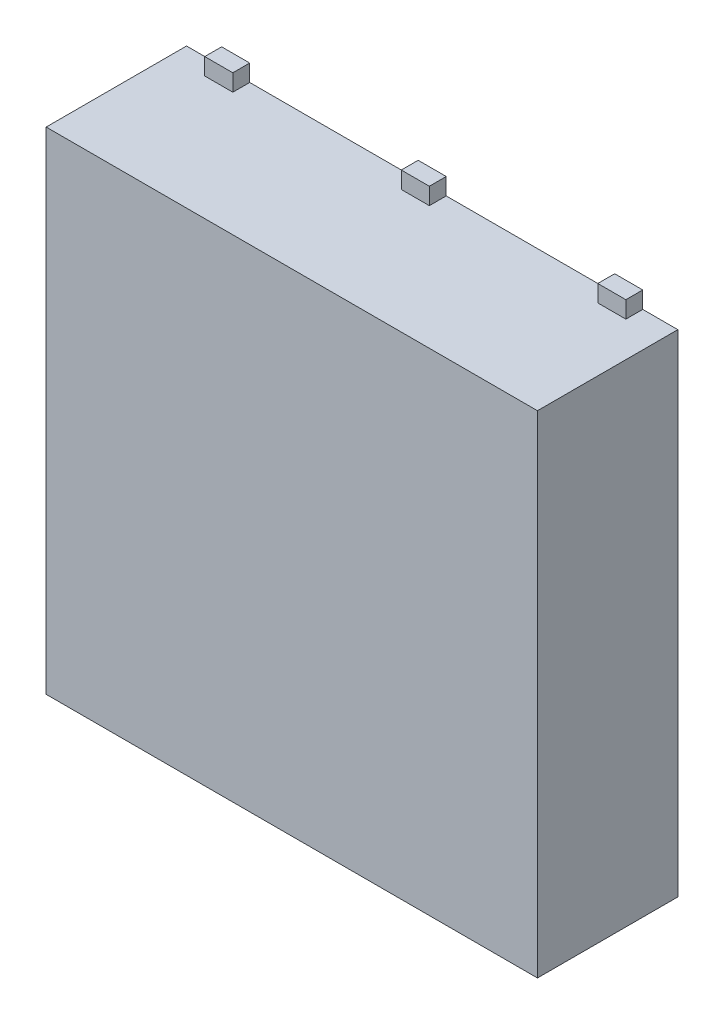
ISO-10303-21;
HEADER;
FILE_DESCRIPTION(('STEP AP214'),'2;1');
FILE_NAME('part.step','',(''),(''),'','','');
FILE_SCHEMA(('AUTOMOTIVE_DESIGN { 1 0 10303 214 1 1 1 1 }'));
ENDSEC;
DATA;
#1=APPLICATION_CONTEXT('core data for automotive mechanical design processes');
#2=APPLICATION_PROTOCOL_DEFINITION('international standard','automotive_design',2000,#1);
#3=PRODUCT_CONTEXT('',#1,'mechanical');
#4=PRODUCT('Part','Part','',(#3));
#5=PRODUCT_RELATED_PRODUCT_CATEGORY('part','',(#4));
#6=PRODUCT_DEFINITION_FORMATION('','',#4);
#7=PRODUCT_DEFINITION_CONTEXT('part definition',#1,'design');
#8=PRODUCT_DEFINITION('design','',#6,#7);
#9=PRODUCT_DEFINITION_SHAPE('','',#8);
#10=(LENGTH_UNIT() NAMED_UNIT(*) SI_UNIT(.MILLI.,.METRE.));
#11=(NAMED_UNIT(*) PLANE_ANGLE_UNIT() SI_UNIT($,.RADIAN.));
#12=(NAMED_UNIT(*) SI_UNIT($,.STERADIAN.) SOLID_ANGLE_UNIT());
#13=UNCERTAINTY_MEASURE_WITH_UNIT(LENGTH_MEASURE(1.E-05),#10,'distance_accuracy_value','');
#14=(GEOMETRIC_REPRESENTATION_CONTEXT(3) GLOBAL_UNCERTAINTY_ASSIGNED_CONTEXT((#13)) GLOBAL_UNIT_ASSIGNED_CONTEXT((#10,
#11,#12)) REPRESENTATION_CONTEXT('',''));
#15=CARTESIAN_POINT('',(0.,0.,0.));
#16=DIRECTION('',(0.,0.,1.));
#17=DIRECTION('',(1.,0.,0.));
#18=AXIS2_PLACEMENT_3D('',#15,#16,#17);
#19=CARTESIAN_POINT('',(-1.75,1.75,1.));
#20=DIRECTION('',(0.,-1.,0.));
#21=DIRECTION('',(1.,0.,0.));
#22=AXIS2_PLACEMENT_3D('',#19,#20,#21);
#23=PLANE('',#22);
#24=DIRECTION('',(0.,0.,1.));
#25=VECTOR('',#24,1.);
#26=CARTESIAN_POINT('',(1.3,1.75,0.));
#27=LINE('',#26,#25);
#28=CARTESIAN_POINT('',(1.3,1.75,0.));
#29=VERTEX_POINT('',#28);
#30=CARTESIAN_POINT('',(1.3,1.75,0.120247062166505));
#31=VERTEX_POINT('',#30);
#32=EDGE_CURVE('E316',#29,#31,#27,.T.);
#33=ORIENTED_EDGE('',*,*,#32,.F.);
#34=DIRECTION('',(-1.,0.,0.));
#35=VECTOR('',#34,1.);
#36=CARTESIAN_POINT('',(-1.75,1.75,0.));
#37=LINE('',#36,#35);
#38=CARTESIAN_POINT('',(0.0999999999999998,1.75,0.));
#39=VERTEX_POINT('',#38);
#40=EDGE_CURVE('E429',#29,#39,#37,.T.);
#41=ORIENTED_EDGE('',*,*,#40,.T.);
#42=DIRECTION('',(0.,0.,-1.));
#43=VECTOR('',#42,1.);
#44=CARTESIAN_POINT('',(0.0999999999999997,1.75,0.));
#45=LINE('',#44,#43);
#46=CARTESIAN_POINT('',(0.0999999999999999,1.75,0.120247062166505));
#47=VERTEX_POINT('',#46);
#48=EDGE_CURVE('E381',#47,#39,#45,.T.);
#49=ORIENTED_EDGE('',*,*,#48,.F.);
#50=DIRECTION('',(1.,0.,0.));
#51=VECTOR('',#50,1.);
#52=CARTESIAN_POINT('',(-0.1,1.75,0.120247062166505));
#53=LINE('',#52,#51);
#54=CARTESIAN_POINT('',(-0.1,1.75,0.120247062166505));
#55=VERTEX_POINT('',#54);
#56=EDGE_CURVE('E390',#55,#47,#53,.T.);
#57=ORIENTED_EDGE('',*,*,#56,.F.);
#58=DIRECTION('',(0.,0.,1.));
#59=VECTOR('',#58,1.);
#60=CARTESIAN_POINT('',(-0.1,1.75,0.));
#61=LINE('',#60,#59);
#62=CARTESIAN_POINT('',(-0.1,1.75,0.));
#63=VERTEX_POINT('',#62);
#64=EDGE_CURVE('E376',#63,#55,#61,.T.);
#65=ORIENTED_EDGE('',*,*,#64,.F.);
#66=CARTESIAN_POINT('',(-1.3,1.75,0.));
#67=VERTEX_POINT('',#66);
#68=EDGE_CURVE('E430',#63,#67,#37,.T.);
#69=ORIENTED_EDGE('',*,*,#68,.T.);
#70=DIRECTION('',(0.,0.,-1.));
#71=VECTOR('',#70,1.);
#72=CARTESIAN_POINT('',(-1.3,1.75,0.));
#73=LINE('',#72,#71);
#74=CARTESIAN_POINT('',(-1.3,1.75,0.120247062166505));
#75=VERTEX_POINT('',#74);
#76=EDGE_CURVE('E351',#75,#67,#73,.T.);
#77=ORIENTED_EDGE('',*,*,#76,.F.);
#78=DIRECTION('',(1.,0.,0.));
#79=VECTOR('',#78,1.);
#80=CARTESIAN_POINT('',(-1.5,1.75,0.120247062166505));
#81=LINE('',#80,#79);
#82=CARTESIAN_POINT('',(-1.5,1.75,0.120247062166505));
#83=VERTEX_POINT('',#82);
#84=EDGE_CURVE('E360',#83,#75,#81,.T.);
#85=ORIENTED_EDGE('',*,*,#84,.F.);
#86=DIRECTION('',(0.,0.,1.));
#87=VECTOR('',#86,1.);
#88=CARTESIAN_POINT('',(-1.5,1.75,0.));
#89=LINE('',#88,#87);
#90=CARTESIAN_POINT('',(-1.5,1.75,0.));
#91=VERTEX_POINT('',#90);
#92=EDGE_CURVE('E346',#91,#83,#89,.T.);
#93=ORIENTED_EDGE('',*,*,#92,.F.);
#94=CARTESIAN_POINT('',(-1.75,1.75,0.));
#95=VERTEX_POINT('',#94);
#96=EDGE_CURVE('E427',#91,#95,#37,.T.);
#97=ORIENTED_EDGE('',*,*,#96,.T.);
#98=DIRECTION('',(0.,0.,-1.));
#99=VECTOR('',#98,1.);
#100=CARTESIAN_POINT('',(-1.75,1.75,1.));
#101=LINE('',#100,#99);
#102=CARTESIAN_POINT('',(-1.75,1.75,1.));
#103=VERTEX_POINT('',#102);
#104=EDGE_CURVE('E417',#103,#95,#101,.T.);
#105=ORIENTED_EDGE('',*,*,#104,.F.);
#106=DIRECTION('',(-1.,0.,0.));
#107=VECTOR('',#106,1.);
#108=CARTESIAN_POINT('',(-1.75,1.75,1.));
#109=LINE('',#108,#107);
#110=CARTESIAN_POINT('',(1.75,1.75,1.));
#111=VERTEX_POINT('',#110);
#112=EDGE_CURVE('E415',#111,#103,#109,.T.);
#113=ORIENTED_EDGE('',*,*,#112,.F.);
#114=DIRECTION('',(0.,0.,-1.));
#115=VECTOR('',#114,1.);
#116=CARTESIAN_POINT('',(1.75,1.75,1.));
#117=LINE('',#116,#115);
#118=CARTESIAN_POINT('',(1.75,1.75,0.));
#119=VERTEX_POINT('',#118);
#120=EDGE_CURVE('E433',#111,#119,#117,.T.);
#121=ORIENTED_EDGE('',*,*,#120,.T.);
#122=CARTESIAN_POINT('',(1.5,1.75,0.));
#123=VERTEX_POINT('',#122);
#124=EDGE_CURVE('E411',#119,#123,#37,.T.);
#125=ORIENTED_EDGE('',*,*,#124,.T.);
#126=DIRECTION('',(0.,0.,-1.));
#127=VECTOR('',#126,1.);
#128=CARTESIAN_POINT('',(1.5,1.75,0.));
#129=LINE('',#128,#127);
#130=CARTESIAN_POINT('',(1.5,1.75,0.120247062166505));
#131=VERTEX_POINT('',#130);
#132=EDGE_CURVE('E321',#131,#123,#129,.T.);
#133=ORIENTED_EDGE('',*,*,#132,.F.);
#134=DIRECTION('',(1.,0.,0.));
#135=VECTOR('',#134,1.);
#136=CARTESIAN_POINT('',(1.3,1.75,0.120247062166505));
#137=LINE('',#136,#135);
#138=EDGE_CURVE('E330',#31,#131,#137,.T.);
#139=ORIENTED_EDGE('',*,*,#138,.F.);
#140=EDGE_LOOP('',(#33,#41,#49,#57,#65,#69,#77,#85,#93,#97,#105,#113,#121,#125,#133,#139));
#141=FACE_BOUND('',#140,.T.);
#142=ADVANCED_FACE('F34',(#141),#23,.F.);
#143=CARTESIAN_POINT('',(-1.75,1.75,1.));
#144=DIRECTION('',(1.,0.,0.));
#145=DIRECTION('',(0.,0.,-1.));
#146=AXIS2_PLACEMENT_3D('',#143,#144,#145);
#147=PLANE('',#146);
#148=DIRECTION('',(0.,-1.,0.));
#149=VECTOR('',#148,1.);
#150=CARTESIAN_POINT('',(-1.75,1.75,0.));
#151=LINE('',#150,#149);
#152=CARTESIAN_POINT('',(-1.75,-1.75,0.));
#153=VERTEX_POINT('',#152);
#154=EDGE_CURVE('E406',#95,#153,#151,.T.);
#155=ORIENTED_EDGE('',*,*,#154,.T.);
#156=DIRECTION('',(0.,0.,-1.));
#157=VECTOR('',#156,1.);
#158=CARTESIAN_POINT('',(-1.75,-1.75,1.));
#159=LINE('',#158,#157);
#160=CARTESIAN_POINT('',(-1.75,-1.75,1.));
#161=VERTEX_POINT('',#160);
#162=EDGE_CURVE('E11',#161,#153,#159,.T.);
#163=ORIENTED_EDGE('',*,*,#162,.F.);
#164=DIRECTION('',(0.,-1.,0.));
#165=VECTOR('',#164,1.);
#166=CARTESIAN_POINT('',(-1.75,1.75,1.));
#167=LINE('',#166,#165);
#168=EDGE_CURVE('E407',#103,#161,#167,.T.);
#169=ORIENTED_EDGE('',*,*,#168,.F.);
#170=ORIENTED_EDGE('',*,*,#104,.T.);
#171=EDGE_LOOP('',(#155,#163,#169,#170));
#172=FACE_BOUND('',#171,.T.);
#173=ADVANCED_FACE('F36',(#172),#147,.F.);
#174=CARTESIAN_POINT('',(-1.75,-1.75,1.));
#175=DIRECTION('',(0.,1.,0.));
#176=DIRECTION('',(-1.,0.,0.));
#177=AXIS2_PLACEMENT_3D('',#174,#175,#176);
#178=PLANE('',#177);
#179=DIRECTION('',(1.,0.,0.));
#180=VECTOR('',#179,1.);
#181=CARTESIAN_POINT('',(-1.75,-1.75,0.));
#182=LINE('',#181,#180);
#183=CARTESIAN_POINT('',(0.0999999999999998,-1.75,0.));
#184=VERTEX_POINT('',#183);
#185=CARTESIAN_POINT('',(1.3,-1.75,0.));
#186=VERTEX_POINT('',#185);
#187=EDGE_CURVE('E425',#184,#186,#182,.T.);
#188=ORIENTED_EDGE('',*,*,#187,.T.);
#189=DIRECTION('',(0.,0.,1.));
#190=VECTOR('',#189,1.);
#191=CARTESIAN_POINT('',(1.3,-1.75,0.));
#192=LINE('',#191,#190);
#193=CARTESIAN_POINT('',(1.3,-1.75,0.120247062166505));
#194=VERTEX_POINT('',#193);
#195=EDGE_CURVE('E54',#186,#194,#192,.T.);
#196=ORIENTED_EDGE('',*,*,#195,.T.);
#197=DIRECTION('',(1.,0.,0.));
#198=VECTOR('',#197,1.);
#199=CARTESIAN_POINT('',(1.3,-1.75,0.120247062166505));
#200=LINE('',#199,#198);
#201=CARTESIAN_POINT('',(1.5,-1.75,0.120247062166505));
#202=VERTEX_POINT('',#201);
#203=EDGE_CURVE('E49',#194,#202,#200,.T.);
#204=ORIENTED_EDGE('',*,*,#203,.T.);
#205=DIRECTION('',(0.,0.,-1.));
#206=VECTOR('',#205,1.);
#207=CARTESIAN_POINT('',(1.5,-1.75,0.));
#208=LINE('',#207,#206);
#209=CARTESIAN_POINT('',(1.5,-1.75,0.));
#210=VERTEX_POINT('',#209);
#211=EDGE_CURVE('E249',#202,#210,#208,.T.);
#212=ORIENTED_EDGE('',*,*,#211,.T.);
#213=CARTESIAN_POINT('',(1.75,-1.75,0.));
#214=VERTEX_POINT('',#213);
#215=EDGE_CURVE('E420',#210,#214,#182,.T.);
#216=ORIENTED_EDGE('',*,*,#215,.T.);
#217=DIRECTION('',(0.,0.,-1.));
#218=VECTOR('',#217,1.);
#219=CARTESIAN_POINT('',(1.75,-1.75,1.));
#220=LINE('',#219,#218);
#221=CARTESIAN_POINT('',(1.75,-1.75,1.));
#222=VERTEX_POINT('',#221);
#223=EDGE_CURVE('E42',#222,#214,#220,.T.);
#224=ORIENTED_EDGE('',*,*,#223,.F.);
#225=DIRECTION('',(1.,0.,0.));
#226=VECTOR('',#225,1.);
#227=CARTESIAN_POINT('',(-1.75,-1.75,1.));
#228=LINE('',#227,#226);
#229=EDGE_CURVE('E410',#161,#222,#228,.T.);
#230=ORIENTED_EDGE('',*,*,#229,.F.);
#231=ORIENTED_EDGE('',*,*,#162,.T.);
#232=CARTESIAN_POINT('',(-1.5,-1.75,0.));
#233=VERTEX_POINT('',#232);
#234=EDGE_CURVE('E421',#153,#233,#182,.T.);
#235=ORIENTED_EDGE('',*,*,#234,.T.);
#236=DIRECTION('',(0.,0.,1.));
#237=VECTOR('',#236,1.);
#238=CARTESIAN_POINT('',(-1.5,-1.75,0.));
#239=LINE('',#238,#237);
#240=CARTESIAN_POINT('',(-1.5,-1.75,0.120247062166505));
#241=VERTEX_POINT('',#240);
#242=EDGE_CURVE('E227',#233,#241,#239,.T.);
#243=ORIENTED_EDGE('',*,*,#242,.T.);
#244=DIRECTION('',(1.,0.,0.));
#245=VECTOR('',#244,1.);
#246=CARTESIAN_POINT('',(-1.5,-1.75,0.120247062166505));
#247=LINE('',#246,#245);
#248=CARTESIAN_POINT('',(-1.3,-1.75,0.120247062166505));
#249=VERTEX_POINT('',#248);
#250=EDGE_CURVE('E260',#241,#249,#247,.T.);
#251=ORIENTED_EDGE('',*,*,#250,.T.);
#252=DIRECTION('',(0.,0.,-1.));
#253=VECTOR('',#252,1.);
#254=CARTESIAN_POINT('',(-1.3,-1.75,0.));
#255=LINE('',#254,#253);
#256=CARTESIAN_POINT('',(-1.3,-1.75,0.));
#257=VERTEX_POINT('',#256);
#258=EDGE_CURVE('E271',#249,#257,#255,.T.);
#259=ORIENTED_EDGE('',*,*,#258,.T.);
#260=CARTESIAN_POINT('',(-0.1,-1.75,0.));
#261=VERTEX_POINT('',#260);
#262=EDGE_CURVE('E424',#257,#261,#182,.T.);
#263=ORIENTED_EDGE('',*,*,#262,.T.);
#264=DIRECTION('',(0.,0.,1.));
#265=VECTOR('',#264,1.);
#266=CARTESIAN_POINT('',(-0.1,-1.75,0.));
#267=LINE('',#266,#265);
#268=CARTESIAN_POINT('',(-0.1,-1.75,0.120247062166505));
#269=VERTEX_POINT('',#268);
#270=EDGE_CURVE('E286',#261,#269,#267,.T.);
#271=ORIENTED_EDGE('',*,*,#270,.T.);
#272=DIRECTION('',(1.,0.,0.));
#273=VECTOR('',#272,1.);
#274=CARTESIAN_POINT('',(-0.1,-1.75,0.120247062166505));
#275=LINE('',#274,#273);
#276=CARTESIAN_POINT('',(0.0999999999999999,-1.75,0.120247062166505));
#277=VERTEX_POINT('',#276);
#278=EDGE_CURVE('E291',#269,#277,#275,.T.);
#279=ORIENTED_EDGE('',*,*,#278,.T.);
#280=DIRECTION('',(0.,0.,-1.));
#281=VECTOR('',#280,1.);
#282=CARTESIAN_POINT('',(0.0999999999999997,-1.75,0.));
#283=LINE('',#282,#281);
#284=EDGE_CURVE('E303',#277,#184,#283,.T.);
#285=ORIENTED_EDGE('',*,*,#284,.T.);
#286=EDGE_LOOP('',(#188,#196,#204,#212,#216,#224,#230,#231,#235,#243,#251,#259,#263,#271,#279,#285));
#287=FACE_BOUND('',#286,.T.);
#288=ADVANCED_FACE('F468',(#287),#178,.F.);
#289=CARTESIAN_POINT('',(1.75,1.75,1.));
#290=DIRECTION('',(-1.,0.,0.));
#291=DIRECTION('',(0.,-1.,0.));
#292=AXIS2_PLACEMENT_3D('',#289,#290,#291);
#293=PLANE('',#292);
#294=DIRECTION('',(0.,1.,0.));
#295=VECTOR('',#294,1.);
#296=CARTESIAN_POINT('',(1.75,1.75,0.));
#297=LINE('',#296,#295);
#298=EDGE_CURVE('E423',#214,#119,#297,.T.);
#299=ORIENTED_EDGE('',*,*,#298,.T.);
#300=ORIENTED_EDGE('',*,*,#120,.F.);
#301=DIRECTION('',(0.,1.,0.));
#302=VECTOR('',#301,1.);
#303=CARTESIAN_POINT('',(1.75,1.75,1.));
#304=LINE('',#303,#302);
#305=EDGE_CURVE('E413',#222,#111,#304,.T.);
#306=ORIENTED_EDGE('',*,*,#305,.F.);
#307=ORIENTED_EDGE('',*,*,#223,.T.);
#308=EDGE_LOOP('',(#299,#300,#306,#307));
#309=FACE_BOUND('',#308,.T.);
#310=ADVANCED_FACE('F440',(#309),#293,.F.);
#311=CARTESIAN_POINT('',(0.,0.,1.));
#312=DIRECTION('',(0.,0.,1.));
#313=DIRECTION('',(1.,0.,0.));
#314=AXIS2_PLACEMENT_3D('',#311,#312,#313);
#315=PLANE('',#314);
#316=ORIENTED_EDGE('',*,*,#168,.T.);
#317=ORIENTED_EDGE('',*,*,#229,.T.);
#318=ORIENTED_EDGE('',*,*,#305,.T.);
#319=ORIENTED_EDGE('',*,*,#112,.T.);
#320=EDGE_LOOP('',(#316,#317,#318,#319));
#321=FACE_BOUND('',#320,.T.);
#322=ADVANCED_FACE('F470',(#321),#315,.T.);
#323=CARTESIAN_POINT('',(0.,0.,0.));
#324=DIRECTION('',(0.,0.,1.));
#325=DIRECTION('',(1.,0.,0.));
#326=AXIS2_PLACEMENT_3D('',#323,#324,#325);
#327=PLANE('',#326);
#328=ORIENTED_EDGE('',*,*,#154,.F.);
#329=ORIENTED_EDGE('',*,*,#96,.F.);
#330=DIRECTION('',(0.,-1.,0.));
#331=VECTOR('',#330,1.);
#332=CARTESIAN_POINT('',(-1.5,1.87,0.));
#333=LINE('',#332,#331);
#334=CARTESIAN_POINT('',(-1.5,1.87,0.));
#335=VERTEX_POINT('',#334);
#336=EDGE_CURVE('E357',#335,#91,#333,.T.);
#337=ORIENTED_EDGE('',*,*,#336,.F.);
#338=DIRECTION('',(-1.,0.,0.));
#339=VECTOR('',#338,1.);
#340=CARTESIAN_POINT('',(-1.5,1.87,0.));
#341=LINE('',#340,#339);
#342=CARTESIAN_POINT('',(-1.3,1.87,0.));
#343=VERTEX_POINT('',#342);
#344=EDGE_CURVE('E355',#343,#335,#341,.T.);
#345=ORIENTED_EDGE('',*,*,#344,.F.);
#346=DIRECTION('',(0.,-1.,0.));
#347=VECTOR('',#346,1.);
#348=CARTESIAN_POINT('',(-1.3,1.87,0.));
#349=LINE('',#348,#347);
#350=EDGE_CURVE('E367',#343,#67,#349,.T.);
#351=ORIENTED_EDGE('',*,*,#350,.T.);
#352=ORIENTED_EDGE('',*,*,#68,.F.);
#353=DIRECTION('',(0.,-1.,0.));
#354=VECTOR('',#353,1.);
#355=CARTESIAN_POINT('',(-0.1,1.87,0.));
#356=LINE('',#355,#354);
#357=CARTESIAN_POINT('',(-0.1,1.87,0.));
#358=VERTEX_POINT('',#357);
#359=EDGE_CURVE('E387',#358,#63,#356,.T.);
#360=ORIENTED_EDGE('',*,*,#359,.F.);
#361=DIRECTION('',(-1.,0.,0.));
#362=VECTOR('',#361,1.);
#363=CARTESIAN_POINT('',(-0.1,1.87,0.));
#364=LINE('',#363,#362);
#365=CARTESIAN_POINT('',(0.0999999999999997,1.87,0.));
#366=VERTEX_POINT('',#365);
#367=EDGE_CURVE('E385',#366,#358,#364,.T.);
#368=ORIENTED_EDGE('',*,*,#367,.F.);
#369=DIRECTION('',(0.,-1.,0.));
#370=VECTOR('',#369,1.);
#371=CARTESIAN_POINT('',(0.0999999999999997,1.87,0.));
#372=LINE('',#371,#370);
#373=EDGE_CURVE('E397',#366,#39,#372,.T.);
#374=ORIENTED_EDGE('',*,*,#373,.T.);
#375=ORIENTED_EDGE('',*,*,#40,.F.);
#376=DIRECTION('',(0.,-1.,0.));
#377=VECTOR('',#376,1.);
#378=CARTESIAN_POINT('',(1.3,1.87,0.));
#379=LINE('',#378,#377);
#380=CARTESIAN_POINT('',(1.3,1.87,0.));
#381=VERTEX_POINT('',#380);
#382=EDGE_CURVE('E327',#381,#29,#379,.T.);
#383=ORIENTED_EDGE('',*,*,#382,.F.);
#384=DIRECTION('',(-1.,0.,0.));
#385=VECTOR('',#384,1.);
#386=CARTESIAN_POINT('',(1.3,1.87,0.));
#387=LINE('',#386,#385);
#388=CARTESIAN_POINT('',(1.5,1.87,0.));
#389=VERTEX_POINT('',#388);
#390=EDGE_CURVE('E325',#389,#381,#387,.T.);
#391=ORIENTED_EDGE('',*,*,#390,.F.);
#392=DIRECTION('',(0.,-1.,0.));
#393=VECTOR('',#392,1.);
#394=CARTESIAN_POINT('',(1.5,1.87,0.));
#395=LINE('',#394,#393);
#396=EDGE_CURVE('E337',#389,#123,#395,.T.);
#397=ORIENTED_EDGE('',*,*,#396,.T.);
#398=ORIENTED_EDGE('',*,*,#124,.F.);
#399=ORIENTED_EDGE('',*,*,#298,.F.);
#400=ORIENTED_EDGE('',*,*,#215,.F.);
#401=DIRECTION('',(0.,1.,0.));
#402=VECTOR('',#401,1.);
#403=CARTESIAN_POINT('',(1.5,-1.87,0.));
#404=LINE('',#403,#402);
#405=CARTESIAN_POINT('',(1.5,-1.87,0.));
#406=VERTEX_POINT('',#405);
#407=EDGE_CURVE('E228',#406,#210,#404,.T.);
#408=ORIENTED_EDGE('',*,*,#407,.F.);
#409=DIRECTION('',(-1.,0.,0.));
#410=VECTOR('',#409,1.);
#411=CARTESIAN_POINT('',(1.3,-1.87,0.));
#412=LINE('',#411,#410);
#413=CARTESIAN_POINT('',(1.3,-1.87,0.));
#414=VERTEX_POINT('',#413);
#415=EDGE_CURVE('E234',#406,#414,#412,.T.);
#416=ORIENTED_EDGE('',*,*,#415,.T.);
#417=DIRECTION('',(0.,1.,0.));
#418=VECTOR('',#417,1.);
#419=CARTESIAN_POINT('',(1.3,-1.87,0.));
#420=LINE('',#419,#418);
#421=EDGE_CURVE('E219',#414,#186,#420,.T.);
#422=ORIENTED_EDGE('',*,*,#421,.T.);
#423=ORIENTED_EDGE('',*,*,#187,.F.);
#424=DIRECTION('',(0.,1.,0.));
#425=VECTOR('',#424,1.);
#426=CARTESIAN_POINT('',(0.0999999999999997,-1.87,0.));
#427=LINE('',#426,#425);
#428=CARTESIAN_POINT('',(0.0999999999999997,-1.87,0.));
#429=VERTEX_POINT('',#428);
#430=EDGE_CURVE('E311',#429,#184,#427,.T.);
#431=ORIENTED_EDGE('',*,*,#430,.F.);
#432=DIRECTION('',(-1.,0.,0.));
#433=VECTOR('',#432,1.);
#434=CARTESIAN_POINT('',(-0.1,-1.87,0.));
#435=LINE('',#434,#433);
#436=CARTESIAN_POINT('',(-0.1,-1.87,0.));
#437=VERTEX_POINT('',#436);
#438=EDGE_CURVE('E290',#429,#437,#435,.T.);
#439=ORIENTED_EDGE('',*,*,#438,.T.);
#440=DIRECTION('',(0.,1.,0.));
#441=VECTOR('',#440,1.);
#442=CARTESIAN_POINT('',(-0.1,-1.87,0.));
#443=LINE('',#442,#441);
#444=EDGE_CURVE('E313',#437,#261,#443,.T.);
#445=ORIENTED_EDGE('',*,*,#444,.T.);
#446=ORIENTED_EDGE('',*,*,#262,.F.);
#447=DIRECTION('',(0.,1.,0.));
#448=VECTOR('',#447,1.);
#449=CARTESIAN_POINT('',(-1.3,-1.87,0.));
#450=LINE('',#449,#448);
#451=CARTESIAN_POINT('',(-1.3,-1.87,0.));
#452=VERTEX_POINT('',#451);
#453=EDGE_CURVE('E280',#452,#257,#450,.T.);
#454=ORIENTED_EDGE('',*,*,#453,.F.);
#455=DIRECTION('',(-1.,0.,0.));
#456=VECTOR('',#455,1.);
#457=CARTESIAN_POINT('',(-1.5,-1.87,0.));
#458=LINE('',#457,#456);
#459=CARTESIAN_POINT('',(-1.5,-1.87,0.));
#460=VERTEX_POINT('',#459);
#461=EDGE_CURVE('E259',#452,#460,#458,.T.);
#462=ORIENTED_EDGE('',*,*,#461,.T.);
#463=DIRECTION('',(0.,1.,0.));
#464=VECTOR('',#463,1.);
#465=CARTESIAN_POINT('',(-1.5,-1.87,0.));
#466=LINE('',#465,#464);
#467=EDGE_CURVE('E283',#460,#233,#466,.T.);
#468=ORIENTED_EDGE('',*,*,#467,.T.);
#469=ORIENTED_EDGE('',*,*,#234,.F.);
#470=EDGE_LOOP('',(#328,#329,#337,#345,#351,#352,#360,#368,#374,#375,#383,#391,#397,#398,#399,
#400,#408,#416,#422,#423,#431,#439,#445,#446,#454,#462,#468,#469));
#471=FACE_BOUND('',#470,.T.);
#472=ADVANCED_FACE('F240',(#471),#327,.F.);
#473=CARTESIAN_POINT('',(-0.1,1.87,0.));
#474=DIRECTION('',(1.,0.,0.));
#475=DIRECTION('',(0.,0.,-1.));
#476=AXIS2_PLACEMENT_3D('',#473,#474,#475);
#477=PLANE('',#476);
#478=ORIENTED_EDGE('',*,*,#64,.T.);
#479=DIRECTION('',(0.,-1.,0.));
#480=VECTOR('',#479,1.);
#481=CARTESIAN_POINT('',(-0.1,1.87,0.120247062166505));
#482=LINE('',#481,#480);
#483=CARTESIAN_POINT('',(-0.1,1.87,0.120247062166505));
#484=VERTEX_POINT('',#483);
#485=EDGE_CURVE('E403',#484,#55,#482,.T.);
#486=ORIENTED_EDGE('',*,*,#485,.F.);
#487=DIRECTION('',(0.,0.,1.));
#488=VECTOR('',#487,1.);
#489=CARTESIAN_POINT('',(-0.1,1.87,0.));
#490=LINE('',#489,#488);
#491=EDGE_CURVE('E377',#358,#484,#490,.T.);
#492=ORIENTED_EDGE('',*,*,#491,.F.);
#493=ORIENTED_EDGE('',*,*,#359,.T.);
#494=EDGE_LOOP('',(#478,#486,#492,#493));
#495=FACE_BOUND('',#494,.T.);
#496=ADVANCED_FACE('F477',(#495),#477,.F.);
#497=CARTESIAN_POINT('',(-0.1,1.87,0.120247062166505));
#498=DIRECTION('',(0.,0.,-1.));
#499=DIRECTION('',(-1.,0.,0.));
#500=AXIS2_PLACEMENT_3D('',#497,#498,#499);
#501=PLANE('',#500);
#502=ORIENTED_EDGE('',*,*,#56,.T.);
#503=DIRECTION('',(0.,-1.,0.));
#504=VECTOR('',#503,1.);
#505=CARTESIAN_POINT('',(0.0999999999999998,1.87,0.120247062166505));
#506=LINE('',#505,#504);
#507=CARTESIAN_POINT('',(0.0999999999999998,1.87,0.120247062166505));
#508=VERTEX_POINT('',#507);
#509=EDGE_CURVE('E400',#508,#47,#506,.T.);
#510=ORIENTED_EDGE('',*,*,#509,.F.);
#511=DIRECTION('',(1.,0.,0.));
#512=VECTOR('',#511,1.);
#513=CARTESIAN_POINT('',(-0.1,1.87,0.120247062166505));
#514=LINE('',#513,#512);
#515=EDGE_CURVE('E380',#484,#508,#514,.T.);
#516=ORIENTED_EDGE('',*,*,#515,.F.);
#517=ORIENTED_EDGE('',*,*,#485,.T.);
#518=EDGE_LOOP('',(#502,#510,#516,#517));
#519=FACE_BOUND('',#518,.T.);
#520=ADVANCED_FACE('F516',(#519),#501,.F.);
#521=CARTESIAN_POINT('',(0.0999999999999997,1.87,0.));
#522=DIRECTION('',(-1.,0.,0.));
#523=DIRECTION('',(0.,0.,1.));
#524=AXIS2_PLACEMENT_3D('',#521,#522,#523);
#525=PLANE('',#524);
#526=ORIENTED_EDGE('',*,*,#48,.T.);
#527=ORIENTED_EDGE('',*,*,#373,.F.);
#528=DIRECTION('',(0.,0.,-1.));
#529=VECTOR('',#528,1.);
#530=CARTESIAN_POINT('',(0.0999999999999997,1.87,0.));
#531=LINE('',#530,#529);
#532=EDGE_CURVE('E383',#508,#366,#531,.T.);
#533=ORIENTED_EDGE('',*,*,#532,.F.);
#534=ORIENTED_EDGE('',*,*,#509,.T.);
#535=EDGE_LOOP('',(#526,#527,#533,#534));
#536=FACE_BOUND('',#535,.T.);
#537=ADVANCED_FACE('F526',(#536),#525,.F.);
#538=CARTESIAN_POINT('',(0.,1.87,0.));
#539=DIRECTION('',(0.,1.,0.));
#540=DIRECTION('',(0.,0.,1.));
#541=AXIS2_PLACEMENT_3D('',#538,#539,#540);
#542=PLANE('',#541);
#543=ORIENTED_EDGE('',*,*,#491,.T.);
#544=ORIENTED_EDGE('',*,*,#515,.T.);
#545=ORIENTED_EDGE('',*,*,#532,.T.);
#546=ORIENTED_EDGE('',*,*,#367,.T.);
#547=EDGE_LOOP('',(#543,#544,#545,#546));
#548=FACE_BOUND('',#547,.T.);
#549=ADVANCED_FACE('F536',(#548),#542,.T.);
#550=CARTESIAN_POINT('',(-1.5,1.87,0.));
#551=DIRECTION('',(1.,0.,0.));
#552=DIRECTION('',(0.,0.,-1.));
#553=AXIS2_PLACEMENT_3D('',#550,#551,#552);
#554=PLANE('',#553);
#555=ORIENTED_EDGE('',*,*,#92,.T.);
#556=DIRECTION('',(0.,-1.,0.));
#557=VECTOR('',#556,1.);
#558=CARTESIAN_POINT('',(-1.5,1.87,0.120247062166505));
#559=LINE('',#558,#557);
#560=CARTESIAN_POINT('',(-1.5,1.87,0.120247062166505));
#561=VERTEX_POINT('',#560);
#562=EDGE_CURVE('E373',#561,#83,#559,.T.);
#563=ORIENTED_EDGE('',*,*,#562,.F.);
#564=DIRECTION('',(0.,0.,1.));
#565=VECTOR('',#564,1.);
#566=CARTESIAN_POINT('',(-1.5,1.87,0.));
#567=LINE('',#566,#565);
#568=EDGE_CURVE('E347',#335,#561,#567,.T.);
#569=ORIENTED_EDGE('',*,*,#568,.F.);
#570=ORIENTED_EDGE('',*,*,#336,.T.);
#571=EDGE_LOOP('',(#555,#563,#569,#570));
#572=FACE_BOUND('',#571,.T.);
#573=ADVANCED_FACE('F546',(#572),#554,.F.);
#574=CARTESIAN_POINT('',(-1.5,1.87,0.120247062166505));
#575=DIRECTION('',(0.,0.,-1.));
#576=DIRECTION('',(-1.,0.,0.));
#577=AXIS2_PLACEMENT_3D('',#574,#575,#576);
#578=PLANE('',#577);
#579=ORIENTED_EDGE('',*,*,#84,.T.);
#580=DIRECTION('',(0.,-1.,0.));
#581=VECTOR('',#580,1.);
#582=CARTESIAN_POINT('',(-1.3,1.87,0.120247062166505));
#583=LINE('',#582,#581);
#584=CARTESIAN_POINT('',(-1.3,1.87,0.120247062166505));
#585=VERTEX_POINT('',#584);
#586=EDGE_CURVE('E370',#585,#75,#583,.T.);
#587=ORIENTED_EDGE('',*,*,#586,.F.);
#588=DIRECTION('',(1.,0.,0.));
#589=VECTOR('',#588,1.);
#590=CARTESIAN_POINT('',(-1.5,1.87,0.120247062166505));
#591=LINE('',#590,#589);
#592=EDGE_CURVE('E350',#561,#585,#591,.T.);
#593=ORIENTED_EDGE('',*,*,#592,.F.);
#594=ORIENTED_EDGE('',*,*,#562,.T.);
#595=EDGE_LOOP('',(#579,#587,#593,#594));
#596=FACE_BOUND('',#595,.T.);
#597=ADVANCED_FACE('F558',(#596),#578,.F.);
#598=CARTESIAN_POINT('',(-1.3,1.87,0.));
#599=DIRECTION('',(-1.,0.,0.));
#600=DIRECTION('',(0.,0.,1.));
#601=AXIS2_PLACEMENT_3D('',#598,#599,#600);
#602=PLANE('',#601);
#603=ORIENTED_EDGE('',*,*,#76,.T.);
#604=ORIENTED_EDGE('',*,*,#350,.F.);
#605=DIRECTION('',(0.,0.,-1.));
#606=VECTOR('',#605,1.);
#607=CARTESIAN_POINT('',(-1.3,1.87,0.));
#608=LINE('',#607,#606);
#609=EDGE_CURVE('E353',#585,#343,#608,.T.);
#610=ORIENTED_EDGE('',*,*,#609,.F.);
#611=ORIENTED_EDGE('',*,*,#586,.T.);
#612=EDGE_LOOP('',(#603,#604,#610,#611));
#613=FACE_BOUND('',#612,.T.);
#614=ADVANCED_FACE('F569',(#613),#602,.F.);
#615=CARTESIAN_POINT('',(-1.4,1.87,0.));
#616=DIRECTION('',(0.,1.,0.));
#617=DIRECTION('',(0.,0.,1.));
#618=AXIS2_PLACEMENT_3D('',#615,#616,#617);
#619=PLANE('',#618);
#620=ORIENTED_EDGE('',*,*,#568,.T.);
#621=ORIENTED_EDGE('',*,*,#592,.T.);
#622=ORIENTED_EDGE('',*,*,#609,.T.);
#623=ORIENTED_EDGE('',*,*,#344,.T.);
#624=EDGE_LOOP('',(#620,#621,#622,#623));
#625=FACE_BOUND('',#624,.T.);
#626=ADVANCED_FACE('F580',(#625),#619,.T.);
#627=CARTESIAN_POINT('',(1.3,1.87,0.));
#628=DIRECTION('',(1.,0.,0.));
#629=DIRECTION('',(0.,0.,-1.));
#630=AXIS2_PLACEMENT_3D('',#627,#628,#629);
#631=PLANE('',#630);
#632=ORIENTED_EDGE('',*,*,#32,.T.);
#633=DIRECTION('',(0.,-1.,0.));
#634=VECTOR('',#633,1.);
#635=CARTESIAN_POINT('',(1.3,1.87,0.120247062166505));
#636=LINE('',#635,#634);
#637=CARTESIAN_POINT('',(1.3,1.87,0.120247062166505));
#638=VERTEX_POINT('',#637);
#639=EDGE_CURVE('E343',#638,#31,#636,.T.);
#640=ORIENTED_EDGE('',*,*,#639,.F.);
#641=DIRECTION('',(0.,0.,1.));
#642=VECTOR('',#641,1.);
#643=CARTESIAN_POINT('',(1.3,1.87,0.));
#644=LINE('',#643,#642);
#645=EDGE_CURVE('E317',#381,#638,#644,.T.);
#646=ORIENTED_EDGE('',*,*,#645,.F.);
#647=ORIENTED_EDGE('',*,*,#382,.T.);
#648=EDGE_LOOP('',(#632,#640,#646,#647));
#649=FACE_BOUND('',#648,.T.);
#650=ADVANCED_FACE('F458',(#649),#631,.F.);
#651=CARTESIAN_POINT('',(1.3,1.87,0.120247062166505));
#652=DIRECTION('',(0.,0.,-1.));
#653=DIRECTION('',(-1.,0.,0.));
#654=AXIS2_PLACEMENT_3D('',#651,#652,#653);
#655=PLANE('',#654);
#656=ORIENTED_EDGE('',*,*,#138,.T.);
#657=DIRECTION('',(0.,-1.,0.));
#658=VECTOR('',#657,1.);
#659=CARTESIAN_POINT('',(1.5,1.87,0.120247062166505));
#660=LINE('',#659,#658);
#661=CARTESIAN_POINT('',(1.5,1.87,0.120247062166505));
#662=VERTEX_POINT('',#661);
#663=EDGE_CURVE('E340',#662,#131,#660,.T.);
#664=ORIENTED_EDGE('',*,*,#663,.F.);
#665=DIRECTION('',(1.,0.,0.));
#666=VECTOR('',#665,1.);
#667=CARTESIAN_POINT('',(1.3,1.87,0.120247062166505));
#668=LINE('',#667,#666);
#669=EDGE_CURVE('E320',#638,#662,#668,.T.);
#670=ORIENTED_EDGE('',*,*,#669,.F.);
#671=ORIENTED_EDGE('',*,*,#639,.T.);
#672=EDGE_LOOP('',(#656,#664,#670,#671));
#673=FACE_BOUND('',#672,.T.);
#674=ADVANCED_FACE('F453',(#673),#655,.F.);
#675=CARTESIAN_POINT('',(1.5,1.87,0.));
#676=DIRECTION('',(-1.,0.,0.));
#677=DIRECTION('',(0.,0.,1.));
#678=AXIS2_PLACEMENT_3D('',#675,#676,#677);
#679=PLANE('',#678);
#680=ORIENTED_EDGE('',*,*,#132,.T.);
#681=ORIENTED_EDGE('',*,*,#396,.F.);
#682=DIRECTION('',(0.,0.,-1.));
#683=VECTOR('',#682,1.);
#684=CARTESIAN_POINT('',(1.5,1.87,0.));
#685=LINE('',#684,#683);
#686=EDGE_CURVE('E323',#662,#389,#685,.T.);
#687=ORIENTED_EDGE('',*,*,#686,.F.);
#688=ORIENTED_EDGE('',*,*,#663,.T.);
#689=EDGE_LOOP('',(#680,#681,#687,#688));
#690=FACE_BOUND('',#689,.T.);
#691=ADVANCED_FACE('F449',(#690),#679,.F.);
#692=CARTESIAN_POINT('',(1.4,1.87,0.));
#693=DIRECTION('',(0.,1.,0.));
#694=DIRECTION('',(0.,0.,1.));
#695=AXIS2_PLACEMENT_3D('',#692,#693,#694);
#696=PLANE('',#695);
#697=ORIENTED_EDGE('',*,*,#645,.T.);
#698=ORIENTED_EDGE('',*,*,#669,.T.);
#699=ORIENTED_EDGE('',*,*,#686,.T.);
#700=ORIENTED_EDGE('',*,*,#390,.T.);
#701=EDGE_LOOP('',(#697,#698,#699,#700));
#702=FACE_BOUND('',#701,.T.);
#703=ADVANCED_FACE('F623',(#702),#696,.T.);
#704=CARTESIAN_POINT('',(-0.1,-1.87,0.));
#705=DIRECTION('',(-1.,0.,0.));
#706=DIRECTION('',(0.,0.,1.));
#707=AXIS2_PLACEMENT_3D('',#704,#705,#706);
#708=PLANE('',#707);
#709=ORIENTED_EDGE('',*,*,#270,.F.);
#710=ORIENTED_EDGE('',*,*,#444,.F.);
#711=DIRECTION('',(0.,0.,1.));
#712=VECTOR('',#711,1.);
#713=CARTESIAN_POINT('',(-0.1,-1.87,0.));
#714=LINE('',#713,#712);
#715=CARTESIAN_POINT('',(-0.1,-1.87,0.120247062166505));
#716=VERTEX_POINT('',#715);
#717=EDGE_CURVE('E287',#437,#716,#714,.T.);
#718=ORIENTED_EDGE('',*,*,#717,.T.);
#719=DIRECTION('',(0.,1.,0.));
#720=VECTOR('',#719,1.);
#721=CARTESIAN_POINT('',(-0.1,-1.87,0.120247062166505));
#722=LINE('',#721,#720);
#723=EDGE_CURVE('E300',#716,#269,#722,.T.);
#724=ORIENTED_EDGE('',*,*,#723,.T.);
#725=EDGE_LOOP('',(#709,#710,#718,#724));
#726=FACE_BOUND('',#725,.T.);
#727=ADVANCED_FACE('F632',(#726),#708,.T.);
#728=CARTESIAN_POINT('',(0.0999999999999997,-1.87,0.));
#729=DIRECTION('',(1.,0.,0.));
#730=DIRECTION('',(0.,0.,-1.));
#731=AXIS2_PLACEMENT_3D('',#728,#729,#730);
#732=PLANE('',#731);
#733=ORIENTED_EDGE('',*,*,#284,.F.);
#734=DIRECTION('',(0.,1.,0.));
#735=VECTOR('',#734,1.);
#736=CARTESIAN_POINT('',(0.0999999999999998,-1.87,0.120247062166505));
#737=LINE('',#736,#735);
#738=CARTESIAN_POINT('',(0.0999999999999998,-1.87,0.120247062166505));
#739=VERTEX_POINT('',#738);
#740=EDGE_CURVE('E309',#739,#277,#737,.T.);
#741=ORIENTED_EDGE('',*,*,#740,.F.);
#742=DIRECTION('',(0.,0.,-1.));
#743=VECTOR('',#742,1.);
#744=CARTESIAN_POINT('',(0.0999999999999997,-1.87,0.));
#745=LINE('',#744,#743);
#746=EDGE_CURVE('E294',#739,#429,#745,.T.);
#747=ORIENTED_EDGE('',*,*,#746,.T.);
#748=ORIENTED_EDGE('',*,*,#430,.T.);
#749=EDGE_LOOP('',(#733,#741,#747,#748));
#750=FACE_BOUND('',#749,.T.);
#751=ADVANCED_FACE('F697',(#750),#732,.T.);
#752=CARTESIAN_POINT('',(-0.1,-1.87,0.120247062166505));
#753=DIRECTION('',(0.,0.,1.));
#754=DIRECTION('',(1.,0.,0.));
#755=AXIS2_PLACEMENT_3D('',#752,#753,#754);
#756=PLANE('',#755);
#757=ORIENTED_EDGE('',*,*,#278,.F.);
#758=ORIENTED_EDGE('',*,*,#723,.F.);
#759=DIRECTION('',(1.,0.,0.));
#760=VECTOR('',#759,1.);
#761=CARTESIAN_POINT('',(-0.1,-1.87,0.120247062166505));
#762=LINE('',#761,#760);
#763=EDGE_CURVE('E297',#716,#739,#762,.T.);
#764=ORIENTED_EDGE('',*,*,#763,.T.);
#765=ORIENTED_EDGE('',*,*,#740,.T.);
#766=EDGE_LOOP('',(#757,#758,#764,#765));
#767=FACE_BOUND('',#766,.T.);
#768=ADVANCED_FACE('F687',(#767),#756,.T.);
#769=CARTESIAN_POINT('',(0.,-1.87,0.));
#770=DIRECTION('',(0.,-1.,0.));
#771=DIRECTION('',(0.,0.,1.));
#772=AXIS2_PLACEMENT_3D('',#769,#770,#771);
#773=PLANE('',#772);
#774=ORIENTED_EDGE('',*,*,#717,.F.);
#775=ORIENTED_EDGE('',*,*,#438,.F.);
#776=ORIENTED_EDGE('',*,*,#746,.F.);
#777=ORIENTED_EDGE('',*,*,#763,.F.);
#778=EDGE_LOOP('',(#774,#775,#776,#777));
#779=FACE_BOUND('',#778,.T.);
#780=ADVANCED_FACE('F681',(#779),#773,.T.);
#781=CARTESIAN_POINT('',(-1.5,-1.87,0.));
#782=DIRECTION('',(-1.,0.,0.));
#783=DIRECTION('',(0.,0.,1.));
#784=AXIS2_PLACEMENT_3D('',#781,#782,#783);
#785=PLANE('',#784);
#786=ORIENTED_EDGE('',*,*,#242,.F.);
#787=ORIENTED_EDGE('',*,*,#467,.F.);
#788=DIRECTION('',(0.,0.,1.));
#789=VECTOR('',#788,1.);
#790=CARTESIAN_POINT('',(-1.5,-1.87,0.));
#791=LINE('',#790,#789);
#792=CARTESIAN_POINT('',(-1.5,-1.87,0.120247062166505));
#793=VERTEX_POINT('',#792);
#794=EDGE_CURVE('E256',#460,#793,#791,.T.);
#795=ORIENTED_EDGE('',*,*,#794,.T.);
#796=DIRECTION('',(0.,1.,0.));
#797=VECTOR('',#796,1.);
#798=CARTESIAN_POINT('',(-1.5,-1.87,0.120247062166505));
#799=LINE('',#798,#797);
#800=EDGE_CURVE('E269',#793,#241,#799,.T.);
#801=ORIENTED_EDGE('',*,*,#800,.T.);
#802=EDGE_LOOP('',(#786,#787,#795,#801));
#803=FACE_BOUND('',#802,.T.);
#804=ADVANCED_FACE('F686',(#803),#785,.T.);
#805=CARTESIAN_POINT('',(-1.3,-1.87,0.));
#806=DIRECTION('',(1.,0.,0.));
#807=DIRECTION('',(0.,0.,-1.));
#808=AXIS2_PLACEMENT_3D('',#805,#806,#807);
#809=PLANE('',#808);
#810=ORIENTED_EDGE('',*,*,#258,.F.);
#811=DIRECTION('',(0.,1.,0.));
#812=VECTOR('',#811,1.);
#813=CARTESIAN_POINT('',(-1.3,-1.87,0.120247062166505));
#814=LINE('',#813,#812);
#815=CARTESIAN_POINT('',(-1.3,-1.87,0.120247062166505));
#816=VERTEX_POINT('',#815);
#817=EDGE_CURVE('E277',#816,#249,#814,.T.);
#818=ORIENTED_EDGE('',*,*,#817,.F.);
#819=DIRECTION('',(0.,0.,-1.));
#820=VECTOR('',#819,1.);
#821=CARTESIAN_POINT('',(-1.3,-1.87,0.));
#822=LINE('',#821,#820);
#823=EDGE_CURVE('E263',#816,#452,#822,.T.);
#824=ORIENTED_EDGE('',*,*,#823,.T.);
#825=ORIENTED_EDGE('',*,*,#453,.T.);
#826=EDGE_LOOP('',(#810,#818,#824,#825));
#827=FACE_BOUND('',#826,.T.);
#828=ADVANCED_FACE('F732',(#827),#809,.T.);
#829=CARTESIAN_POINT('',(-1.5,-1.87,0.120247062166505));
#830=DIRECTION('',(0.,0.,1.));
#831=DIRECTION('',(1.,0.,0.));
#832=AXIS2_PLACEMENT_3D('',#829,#830,#831);
#833=PLANE('',#832);
#834=ORIENTED_EDGE('',*,*,#250,.F.);
#835=ORIENTED_EDGE('',*,*,#800,.F.);
#836=DIRECTION('',(1.,0.,0.));
#837=VECTOR('',#836,1.);
#838=CARTESIAN_POINT('',(-1.5,-1.87,0.120247062166505));
#839=LINE('',#838,#837);
#840=EDGE_CURVE('E266',#793,#816,#839,.T.);
#841=ORIENTED_EDGE('',*,*,#840,.T.);
#842=ORIENTED_EDGE('',*,*,#817,.T.);
#843=EDGE_LOOP('',(#834,#835,#841,#842));
#844=FACE_BOUND('',#843,.T.);
#845=ADVANCED_FACE('F724',(#844),#833,.T.);
#846=CARTESIAN_POINT('',(-1.4,-1.87,0.));
#847=DIRECTION('',(0.,-1.,0.));
#848=DIRECTION('',(0.,0.,1.));
#849=AXIS2_PLACEMENT_3D('',#846,#847,#848);
#850=PLANE('',#849);
#851=ORIENTED_EDGE('',*,*,#794,.F.);
#852=ORIENTED_EDGE('',*,*,#461,.F.);
#853=ORIENTED_EDGE('',*,*,#823,.F.);
#854=ORIENTED_EDGE('',*,*,#840,.F.);
#855=EDGE_LOOP('',(#851,#852,#853,#854));
#856=FACE_BOUND('',#855,.T.);
#857=ADVANCED_FACE('F674',(#856),#850,.T.);
#858=CARTESIAN_POINT('',(1.3,-1.87,0.));
#859=DIRECTION('',(-1.,0.,0.));
#860=DIRECTION('',(0.,0.,1.));
#861=AXIS2_PLACEMENT_3D('',#858,#859,#860);
#862=PLANE('',#861);
#863=ORIENTED_EDGE('',*,*,#195,.F.);
#864=ORIENTED_EDGE('',*,*,#421,.F.);
#865=DIRECTION('',(0.,0.,1.));
#866=VECTOR('',#865,1.);
#867=CARTESIAN_POINT('',(1.3,-1.87,0.));
#868=LINE('',#867,#866);
#869=CARTESIAN_POINT('',(1.3,-1.87,0.120247062166505));
#870=VERTEX_POINT('',#869);
#871=EDGE_CURVE('E222',#414,#870,#868,.T.);
#872=ORIENTED_EDGE('',*,*,#871,.T.);
#873=DIRECTION('',(0.,1.,0.));
#874=VECTOR('',#873,1.);
#875=CARTESIAN_POINT('',(1.3,-1.87,0.120247062166505));
#876=LINE('',#875,#874);
#877=EDGE_CURVE('E247',#870,#194,#876,.T.);
#878=ORIENTED_EDGE('',*,*,#877,.T.);
#879=EDGE_LOOP('',(#863,#864,#872,#878));
#880=FACE_BOUND('',#879,.T.);
#881=ADVANCED_FACE('F221',(#880),#862,.T.);
#882=CARTESIAN_POINT('',(1.5,-1.87,0.));
#883=DIRECTION('',(1.,0.,0.));
#884=DIRECTION('',(0.,0.,-1.));
#885=AXIS2_PLACEMENT_3D('',#882,#883,#884);
#886=PLANE('',#885);
#887=ORIENTED_EDGE('',*,*,#211,.F.);
#888=DIRECTION('',(0.,1.,0.));
#889=VECTOR('',#888,1.);
#890=CARTESIAN_POINT('',(1.5,-1.87,0.120247062166505));
#891=LINE('',#890,#889);
#892=CARTESIAN_POINT('',(1.5,-1.87,0.120247062166505));
#893=VERTEX_POINT('',#892);
#894=EDGE_CURVE('E253',#893,#202,#891,.T.);
#895=ORIENTED_EDGE('',*,*,#894,.F.);
#896=DIRECTION('',(0.,0.,-1.));
#897=VECTOR('',#896,1.);
#898=CARTESIAN_POINT('',(1.5,-1.87,0.));
#899=LINE('',#898,#897);
#900=EDGE_CURVE('E242',#893,#406,#899,.T.);
#901=ORIENTED_EDGE('',*,*,#900,.T.);
#902=ORIENTED_EDGE('',*,*,#407,.T.);
#903=EDGE_LOOP('',(#887,#895,#901,#902));
#904=FACE_BOUND('',#903,.T.);
#905=ADVANCED_FACE('F653',(#904),#886,.T.);
#906=CARTESIAN_POINT('',(1.3,-1.87,0.120247062166505));
#907=DIRECTION('',(0.,0.,1.));
#908=DIRECTION('',(1.,0.,0.));
#909=AXIS2_PLACEMENT_3D('',#906,#907,#908);
#910=PLANE('',#909);
#911=ORIENTED_EDGE('',*,*,#203,.F.);
#912=ORIENTED_EDGE('',*,*,#877,.F.);
#913=DIRECTION('',(1.,0.,0.));
#914=VECTOR('',#913,1.);
#915=CARTESIAN_POINT('',(1.3,-1.87,0.120247062166505));
#916=LINE('',#915,#914);
#917=EDGE_CURVE('E237',#870,#893,#916,.T.);
#918=ORIENTED_EDGE('',*,*,#917,.T.);
#919=ORIENTED_EDGE('',*,*,#894,.T.);
#920=EDGE_LOOP('',(#911,#912,#918,#919));
#921=FACE_BOUND('',#920,.T.);
#922=ADVANCED_FACE('F646',(#921),#910,.T.);
#923=CARTESIAN_POINT('',(1.4,-1.87,0.));
#924=DIRECTION('',(0.,-1.,0.));
#925=DIRECTION('',(0.,0.,1.));
#926=AXIS2_PLACEMENT_3D('',#923,#924,#925);
#927=PLANE('',#926);
#928=ORIENTED_EDGE('',*,*,#871,.F.);
#929=ORIENTED_EDGE('',*,*,#415,.F.);
#930=ORIENTED_EDGE('',*,*,#900,.F.);
#931=ORIENTED_EDGE('',*,*,#917,.F.);
#932=EDGE_LOOP('',(#928,#929,#930,#931));
#933=FACE_BOUND('',#932,.T.);
#934=ADVANCED_FACE('F232',(#933),#927,.T.);
#935=CLOSED_SHELL('',(#142,#173,#288,#310,#322,#472,#496,#520,#537,#549,#573,#597,#614,#626,
#650,#674,#691,#703,#727,#751,#768,#780,#804,#828,#845,#857,#881,#905,#922,#934));
#936=MANIFOLD_SOLID_BREP('B2',#935);
#937=ADVANCED_BREP_SHAPE_REPRESENTATION('',(#18,#936),#14);
#938=SHAPE_DEFINITION_REPRESENTATION(#9,#937);
ENDSEC;
END-ISO-10303-21;
